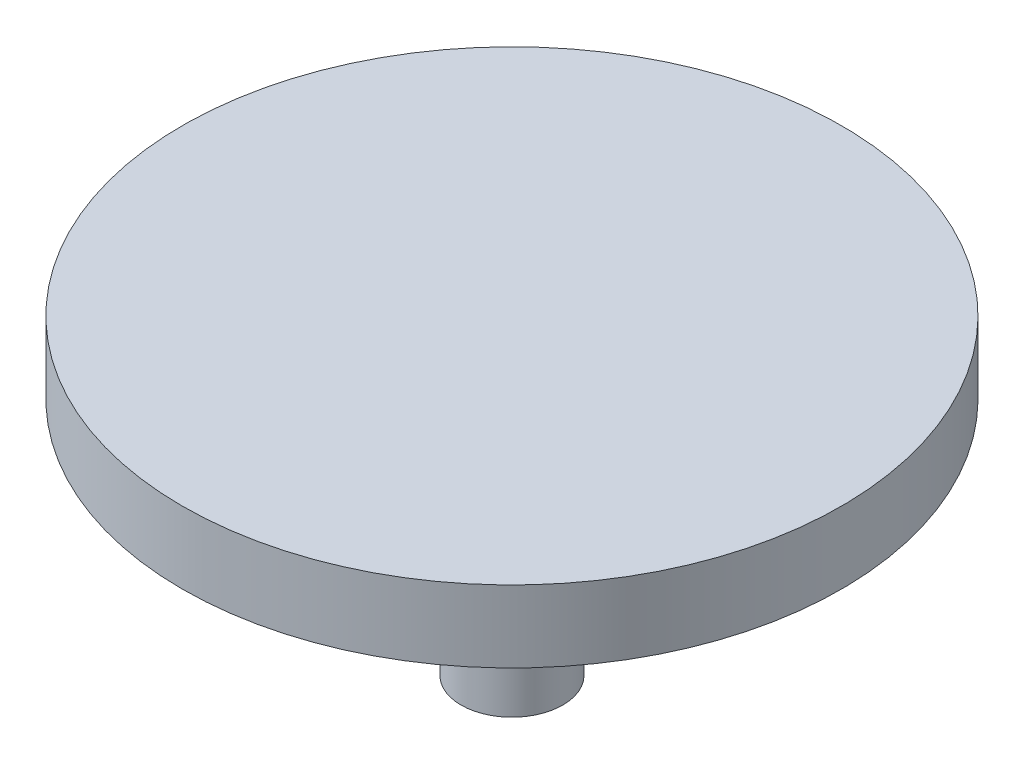
ISO-10303-21;
HEADER;
FILE_DESCRIPTION(('STEP AP214'),'2;1');
FILE_NAME('part.step','',(''),(''),'','','');
FILE_SCHEMA(('AUTOMOTIVE_DESIGN { 1 0 10303 214 1 1 1 1 }'));
ENDSEC;
DATA;
#1=APPLICATION_CONTEXT('core data for automotive mechanical design processes');
#2=APPLICATION_PROTOCOL_DEFINITION('international standard','automotive_design',2000,#1);
#3=PRODUCT_CONTEXT('',#1,'mechanical');
#4=PRODUCT('Part','Part','',(#3));
#5=PRODUCT_RELATED_PRODUCT_CATEGORY('part','',(#4));
#6=PRODUCT_DEFINITION_FORMATION('','',#4);
#7=PRODUCT_DEFINITION_CONTEXT('part definition',#1,'design');
#8=PRODUCT_DEFINITION('design','',#6,#7);
#9=PRODUCT_DEFINITION_SHAPE('','',#8);
#10=(LENGTH_UNIT() NAMED_UNIT(*) SI_UNIT(.MILLI.,.METRE.));
#11=(NAMED_UNIT(*) PLANE_ANGLE_UNIT() SI_UNIT($,.RADIAN.));
#12=(NAMED_UNIT(*) SI_UNIT($,.STERADIAN.) SOLID_ANGLE_UNIT());
#13=UNCERTAINTY_MEASURE_WITH_UNIT(LENGTH_MEASURE(1.E-05),#10,'distance_accuracy_value','');
#14=(GEOMETRIC_REPRESENTATION_CONTEXT(3) GLOBAL_UNCERTAINTY_ASSIGNED_CONTEXT((#13)) GLOBAL_UNIT_ASSIGNED_CONTEXT((#10,
#11,#12)) REPRESENTATION_CONTEXT('',''));
#15=CARTESIAN_POINT('',(0.,0.,0.));
#16=DIRECTION('',(0.,0.,1.));
#17=DIRECTION('',(1.,0.,0.));
#18=AXIS2_PLACEMENT_3D('',#15,#16,#17);
#19=CARTESIAN_POINT('',(0.,20.,0.));
#20=DIRECTION('',(0.,-1.,0.));
#21=DIRECTION('',(0.,0.,-1.));
#22=AXIS2_PLACEMENT_3D('',#19,#20,#21);
#23=CYLINDRICAL_SURFACE('',#22,4.25);
#24=CARTESIAN_POINT('',(0.,20.,0.));
#25=DIRECTION('',(0.,1.,0.));
#26=DIRECTION('',(0.,0.,1.));
#27=AXIS2_PLACEMENT_3D('',#24,#25,#26);
#28=CIRCLE('',#27,4.25);
#29=CARTESIAN_POINT('',(0.,20.,4.25));
#30=VERTEX_POINT('',#29);
#31=EDGE_CURVE('E10',#30,#30,#28,.T.);
#32=ORIENTED_EDGE('',*,*,#31,.F.);
#33=EDGE_LOOP('',(#32));
#34=FACE_BOUND('',#33,.T.);
#35=CARTESIAN_POINT('',(0.,0.,0.));
#36=DIRECTION('',(0.,1.,0.));
#37=DIRECTION('',(0.,0.,1.));
#38=AXIS2_PLACEMENT_3D('',#35,#36,#37);
#39=CIRCLE('',#38,4.25);
#40=CARTESIAN_POINT('',(0.,0.,4.25));
#41=VERTEX_POINT('',#40);
#42=EDGE_CURVE('E34',#41,#41,#39,.T.);
#43=ORIENTED_EDGE('',*,*,#42,.T.);
#44=EDGE_LOOP('',(#43));
#45=FACE_BOUND('',#44,.T.);
#46=ADVANCED_FACE('F31',(#34,#45),#23,.T.);
#47=CARTESIAN_POINT('',(0.,0.,0.));
#48=DIRECTION('',(0.,1.,0.));
#49=DIRECTION('',(0.,0.,1.));
#50=AXIS2_PLACEMENT_3D('',#47,#48,#49);
#51=PLANE('',#50);
#52=ORIENTED_EDGE('',*,*,#42,.F.);
#53=EDGE_LOOP('',(#52));
#54=FACE_BOUND('',#53,.T.);
#55=ADVANCED_FACE('F54',(#54),#51,.F.);
#56=CARTESIAN_POINT('',(0.,26.,0.));
#57=DIRECTION('',(0.,-1.,0.));
#58=DIRECTION('',(0.,0.,-1.));
#59=AXIS2_PLACEMENT_3D('',#56,#57,#58);
#60=CYLINDRICAL_SURFACE('',#59,27.5);
#61=CARTESIAN_POINT('',(0.,26.,0.));
#62=DIRECTION('',(0.,1.,0.));
#63=DIRECTION('',(0.,0.,1.));
#64=AXIS2_PLACEMENT_3D('',#61,#62,#63);
#65=CIRCLE('',#64,27.5);
#66=CARTESIAN_POINT('',(0.,26.,27.5));
#67=VERTEX_POINT('',#66);
#68=EDGE_CURVE('E41',#67,#67,#65,.T.);
#69=ORIENTED_EDGE('',*,*,#68,.F.);
#70=EDGE_LOOP('',(#69));
#71=FACE_BOUND('',#70,.T.);
#72=CARTESIAN_POINT('',(0.,20.,0.));
#73=DIRECTION('',(0.,1.,0.));
#74=DIRECTION('',(0.,0.,1.));
#75=AXIS2_PLACEMENT_3D('',#72,#73,#74);
#76=CIRCLE('',#75,27.5);
#77=CARTESIAN_POINT('',(0.,20.,27.5));
#78=VERTEX_POINT('',#77);
#79=EDGE_CURVE('E43',#78,#78,#76,.T.);
#80=ORIENTED_EDGE('',*,*,#79,.T.);
#81=EDGE_LOOP('',(#80));
#82=FACE_BOUND('',#81,.T.);
#83=ADVANCED_FACE('F51',(#71,#82),#60,.T.);
#84=CARTESIAN_POINT('',(0.,26.,0.));
#85=DIRECTION('',(0.,1.,0.));
#86=DIRECTION('',(0.,0.,1.));
#87=AXIS2_PLACEMENT_3D('',#84,#85,#86);
#88=PLANE('',#87);
#89=ORIENTED_EDGE('',*,*,#68,.T.);
#90=EDGE_LOOP('',(#89));
#91=FACE_BOUND('',#90,.T.);
#92=ADVANCED_FACE('F49',(#91),#88,.T.);
#93=CARTESIAN_POINT('',(0.,20.,0.));
#94=DIRECTION('',(0.,1.,0.));
#95=DIRECTION('',(0.,0.,1.));
#96=AXIS2_PLACEMENT_3D('',#93,#94,#95);
#97=PLANE('',#96);
#98=ORIENTED_EDGE('',*,*,#31,.T.);
#99=EDGE_LOOP('',(#98));
#100=FACE_BOUND('',#99,.T.);
#101=ORIENTED_EDGE('',*,*,#79,.F.);
#102=EDGE_LOOP('',(#101));
#103=FACE_BOUND('',#102,.T.);
#104=ADVANCED_FACE('F58',(#100,#103),#97,.F.);
#105=CLOSED_SHELL('',(#46,#55,#83,#92,#104));
#106=MANIFOLD_SOLID_BREP('B2',#105);
#107=ADVANCED_BREP_SHAPE_REPRESENTATION('',(#18,#106),#14);
#108=SHAPE_DEFINITION_REPRESENTATION(#9,#107);
ENDSEC;
END-ISO-10303-21;
